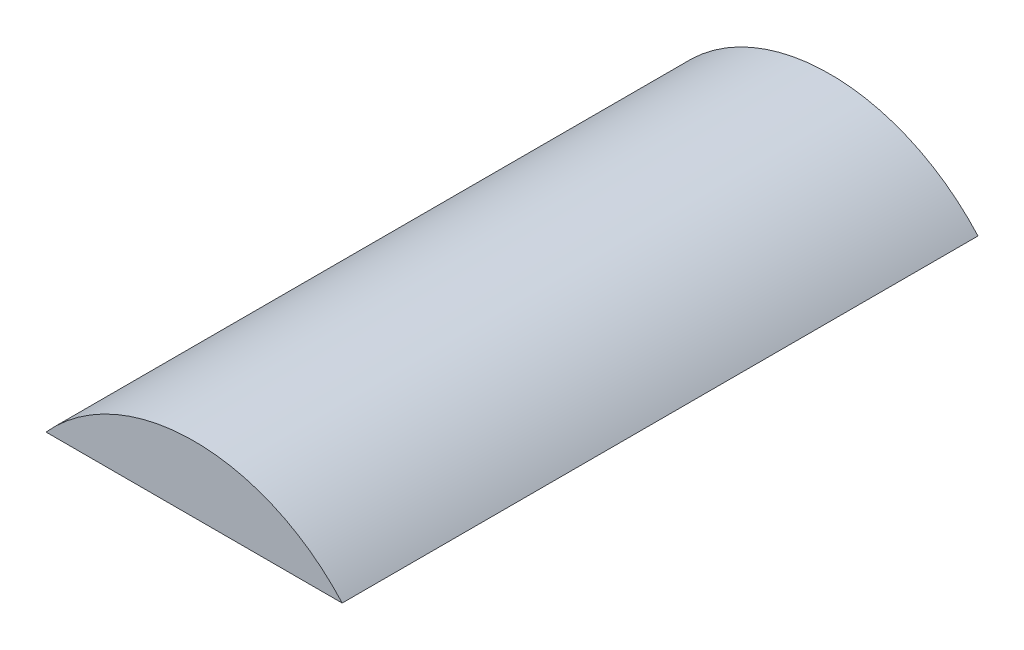
ISO-10303-21;
HEADER;
FILE_DESCRIPTION(('STEP AP214'),'2;1');
FILE_NAME('part.step','',(''),(''),'','','');
FILE_SCHEMA(('AUTOMOTIVE_DESIGN { 1 0 10303 214 1 1 1 1 }'));
ENDSEC;
DATA;
#1=APPLICATION_CONTEXT('core data for automotive mechanical design processes');
#2=APPLICATION_PROTOCOL_DEFINITION('international standard','automotive_design',2000,#1);
#3=PRODUCT_CONTEXT('',#1,'mechanical');
#4=PRODUCT('Part','Part','',(#3));
#5=PRODUCT_RELATED_PRODUCT_CATEGORY('part','',(#4));
#6=PRODUCT_DEFINITION_FORMATION('','',#4);
#7=PRODUCT_DEFINITION_CONTEXT('part definition',#1,'design');
#8=PRODUCT_DEFINITION('design','',#6,#7);
#9=PRODUCT_DEFINITION_SHAPE('','',#8);
#10=(LENGTH_UNIT() NAMED_UNIT(*) SI_UNIT(.MILLI.,.METRE.));
#11=(NAMED_UNIT(*) PLANE_ANGLE_UNIT() SI_UNIT($,.RADIAN.));
#12=(NAMED_UNIT(*) SI_UNIT($,.STERADIAN.) SOLID_ANGLE_UNIT());
#13=UNCERTAINTY_MEASURE_WITH_UNIT(LENGTH_MEASURE(1.E-05),#10,'distance_accuracy_value','');
#14=(GEOMETRIC_REPRESENTATION_CONTEXT(3) GLOBAL_UNCERTAINTY_ASSIGNED_CONTEXT((#13)) GLOBAL_UNIT_ASSIGNED_CONTEXT((#10,
#11,#12)) REPRESENTATION_CONTEXT('',''));
#15=CARTESIAN_POINT('',(0.,0.,0.));
#16=DIRECTION('',(0.,0.,1.));
#17=DIRECTION('',(1.,0.,0.));
#18=AXIS2_PLACEMENT_3D('',#15,#16,#17);
#19=CARTESIAN_POINT('',(0.,1.,-4.8));
#20=DIRECTION('',(0.,-1.,0.));
#21=DIRECTION('',(1.,0.,0.));
#22=AXIS2_PLACEMENT_3D('',#19,#20,#21);
#23=PLANE('',#22);
#24=DIRECTION('',(1.,0.,0.));
#25=VECTOR('',#24,1.);
#26=CARTESIAN_POINT('',(0.,1.,0.));
#27=LINE('',#26,#25);
#28=CARTESIAN_POINT('',(-1.1180339887499,1.,0.));
#29=VERTEX_POINT('',#28);
#30=CARTESIAN_POINT('',(1.11803398874989,1.,0.));
#31=VERTEX_POINT('',#30);
#32=EDGE_CURVE('E70',#29,#31,#27,.T.);
#33=ORIENTED_EDGE('',*,*,#32,.F.);
#34=DIRECTION('',(0.,0.,1.));
#35=VECTOR('',#34,1.);
#36=CARTESIAN_POINT('',(-1.1180339887499,1.,-4.8));
#37=LINE('',#36,#35);
#38=CARTESIAN_POINT('',(-1.1180339887499,1.,-4.8));
#39=VERTEX_POINT('',#38);
#40=EDGE_CURVE('E11',#39,#29,#37,.T.);
#41=ORIENTED_EDGE('',*,*,#40,.F.);
#42=DIRECTION('',(1.,0.,0.));
#43=VECTOR('',#42,1.);
#44=CARTESIAN_POINT('',(0.,1.,-4.8));
#45=LINE('',#44,#43);
#46=CARTESIAN_POINT('',(1.11803398874989,1.,-4.8));
#47=VERTEX_POINT('',#46);
#48=EDGE_CURVE('E74',#39,#47,#45,.T.);
#49=ORIENTED_EDGE('',*,*,#48,.T.);
#50=DIRECTION('',(0.,0.,1.));
#51=VECTOR('',#50,1.);
#52=CARTESIAN_POINT('',(1.11803398874989,1.,-4.8));
#53=LINE('',#52,#51);
#54=EDGE_CURVE('E44',#47,#31,#53,.T.);
#55=ORIENTED_EDGE('',*,*,#54,.T.);
#56=EDGE_LOOP('',(#33,#41,#49,#55));
#57=FACE_BOUND('',#56,.T.);
#58=ADVANCED_FACE('F41',(#57),#23,.T.);
#59=CARTESIAN_POINT('',(0.,0.,-4.8));
#60=DIRECTION('',(0.,0.,1.));
#61=DIRECTION('',(1.,0.,0.));
#62=AXIS2_PLACEMENT_3D('',#59,#60,#61);
#63=CYLINDRICAL_SURFACE('',#62,1.5);
#64=CARTESIAN_POINT('',(0.,0.,0.));
#65=DIRECTION('',(0.,0.,1.));
#66=DIRECTION('',(1.,0.,0.));
#67=AXIS2_PLACEMENT_3D('',#64,#65,#66);
#68=CIRCLE('',#67,1.5);
#69=EDGE_CURVE('E67',#31,#29,#68,.T.);
#70=ORIENTED_EDGE('',*,*,#69,.F.);
#71=ORIENTED_EDGE('',*,*,#54,.F.);
#72=CARTESIAN_POINT('',(0.,0.,-4.8));
#73=DIRECTION('',(0.,0.,1.));
#74=DIRECTION('',(1.,0.,0.));
#75=AXIS2_PLACEMENT_3D('',#72,#73,#74);
#76=CIRCLE('',#75,1.5);
#77=EDGE_CURVE('E69',#47,#39,#76,.T.);
#78=ORIENTED_EDGE('',*,*,#77,.T.);
#79=ORIENTED_EDGE('',*,*,#40,.T.);
#80=EDGE_LOOP('',(#70,#71,#78,#79));
#81=FACE_BOUND('',#80,.T.);
#82=ADVANCED_FACE('F65',(#81),#63,.T.);
#83=CARTESIAN_POINT('',(0.,0.,-4.8));
#84=DIRECTION('',(0.,0.,1.));
#85=DIRECTION('',(1.,0.,0.));
#86=AXIS2_PLACEMENT_3D('',#83,#84,#85);
#87=PLANE('',#86);
#88=ORIENTED_EDGE('',*,*,#48,.F.);
#89=ORIENTED_EDGE('',*,*,#77,.F.);
#90=EDGE_LOOP('',(#88,#89));
#91=FACE_BOUND('',#90,.T.);
#92=ADVANCED_FACE('F79',(#91),#87,.F.);
#93=CARTESIAN_POINT('',(0.,0.,0.));
#94=DIRECTION('',(0.,0.,1.));
#95=DIRECTION('',(1.,0.,0.));
#96=AXIS2_PLACEMENT_3D('',#93,#94,#95);
#97=PLANE('',#96);
#98=ORIENTED_EDGE('',*,*,#32,.T.);
#99=ORIENTED_EDGE('',*,*,#69,.T.);
#100=EDGE_LOOP('',(#98,#99));
#101=FACE_BOUND('',#100,.T.);
#102=ADVANCED_FACE('F73',(#101),#97,.T.);
#103=CLOSED_SHELL('',(#58,#82,#92,#102));
#104=MANIFOLD_SOLID_BREP('B2',#103);
#105=ADVANCED_BREP_SHAPE_REPRESENTATION('',(#18,#104),#14);
#106=SHAPE_DEFINITION_REPRESENTATION(#9,#105);
ENDSEC;
END-ISO-10303-21;
